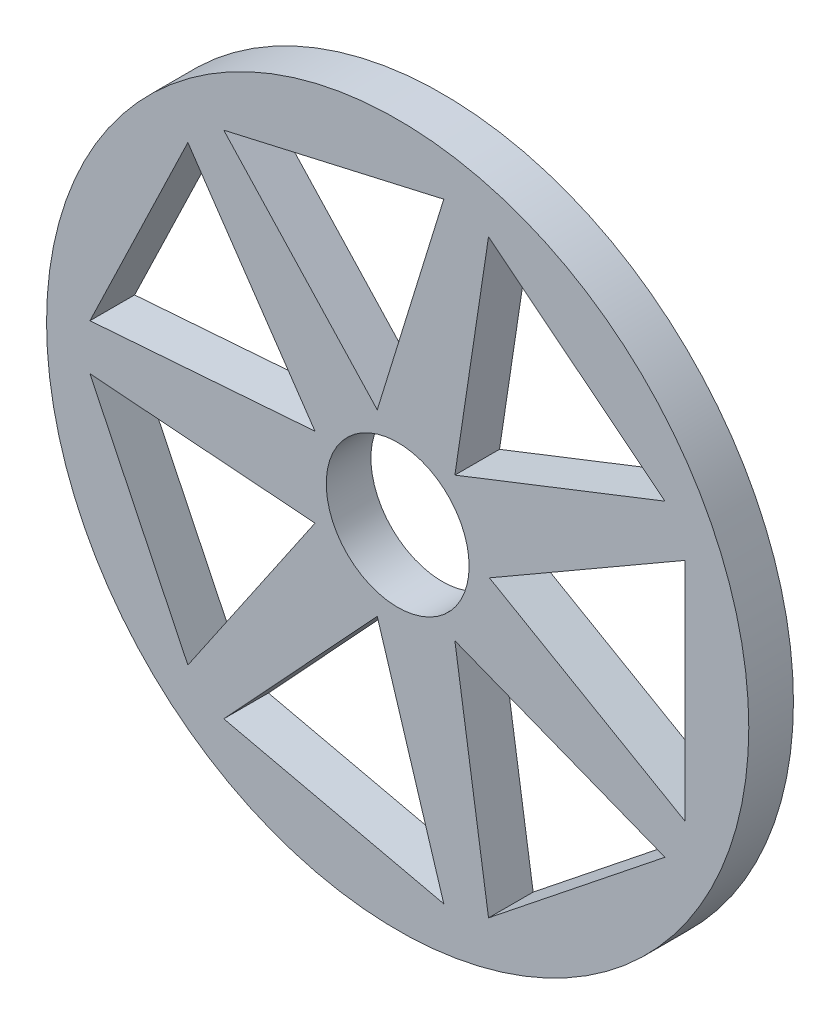
ISO-10303-21;
HEADER;
FILE_DESCRIPTION(('STEP AP214'),'2;1');
FILE_NAME('part.step','',(''),(''),'','','');
FILE_SCHEMA(('AUTOMOTIVE_DESIGN { 1 0 10303 214 1 1 1 1 }'));
ENDSEC;
DATA;
#1=APPLICATION_CONTEXT('core data for automotive mechanical design processes');
#2=APPLICATION_PROTOCOL_DEFINITION('international standard','automotive_design',2000,#1);
#3=PRODUCT_CONTEXT('',#1,'mechanical');
#4=PRODUCT('Part','Part','',(#3));
#5=PRODUCT_RELATED_PRODUCT_CATEGORY('part','',(#4));
#6=PRODUCT_DEFINITION_FORMATION('','',#4);
#7=PRODUCT_DEFINITION_CONTEXT('part definition',#1,'design');
#8=PRODUCT_DEFINITION('design','',#6,#7);
#9=PRODUCT_DEFINITION_SHAPE('','',#8);
#10=(LENGTH_UNIT() NAMED_UNIT(*) SI_UNIT(.MILLI.,.METRE.));
#11=(NAMED_UNIT(*) PLANE_ANGLE_UNIT() SI_UNIT($,.RADIAN.));
#12=(NAMED_UNIT(*) SI_UNIT($,.STERADIAN.) SOLID_ANGLE_UNIT());
#13=UNCERTAINTY_MEASURE_WITH_UNIT(LENGTH_MEASURE(1.E-05),#10,'distance_accuracy_value','');
#14=(GEOMETRIC_REPRESENTATION_CONTEXT(3) GLOBAL_UNCERTAINTY_ASSIGNED_CONTEXT((#13)) GLOBAL_UNIT_ASSIGNED_CONTEXT((#10,
#11,#12)) REPRESENTATION_CONTEXT('',''));
#15=CARTESIAN_POINT('',(0.,0.,0.));
#16=DIRECTION('',(0.,0.,1.));
#17=DIRECTION('',(1.,0.,0.));
#18=AXIS2_PLACEMENT_3D('',#15,#16,#17);
#19=CARTESIAN_POINT('',(-9.14249999999995,0.,6.985));
#20=DIRECTION('',(0.,0.,1.));
#21=DIRECTION('',(1.,0.,0.));
#22=AXIS2_PLACEMENT_3D('',#19,#20,#21);
#23=PLANE('',#22);
#24=CARTESIAN_POINT('',(-9.14249999999995,0.,6.985));
#25=DIRECTION('',(0.,0.,1.));
#26=DIRECTION('',(1.,0.,0.));
#27=AXIS2_PLACEMENT_3D('',#24,#25,#26);
#28=CIRCLE('',#27,54.9290000000001);
#29=CARTESIAN_POINT('',(45.7865000000002,0.,6.985));
#30=VERTEX_POINT('',#29);
#31=EDGE_CURVE('E12',#30,#30,#28,.T.);
#32=ORIENTED_EDGE('',*,*,#31,.T.);
#33=EDGE_LOOP('',(#32));
#34=FACE_BOUND('',#33,.T.);
#35=CARTESIAN_POINT('',(-9.14249999999995,0.,6.985));
#36=DIRECTION('',(0.,0.,1.));
#37=DIRECTION('',(1.,0.,0.));
#38=AXIS2_PLACEMENT_3D('',#35,#36,#37);
#39=CIRCLE('',#38,11.176);
#40=CARTESIAN_POINT('',(2.03350000000005,0.,6.985));
#41=VERTEX_POINT('',#40);
#42=EDGE_CURVE('E426',#41,#41,#39,.T.);
#43=ORIENTED_EDGE('',*,*,#42,.F.);
#44=EDGE_LOOP('',(#43));
#45=FACE_BOUND('',#44,.T.);
#46=DIRECTION('',(0.866025403784436,0.500000000000004,0.));
#47=VECTOR('',#46,1.);
#48=CARTESIAN_POINT('',(1.30212500000004,-2.25534665780566,6.98499999999996));
#49=LINE('',#48,#47);
#50=CARTESIAN_POINT('',(5.20850000000006,0.,6.985));
#51=VERTEX_POINT('',#50);
#52=CARTESIAN_POINT('',(35.7865000000002,17.6542165312807,6.98499999999996));
#53=VERTEX_POINT('',#52);
#54=EDGE_CURVE('E414',#51,#53,#49,.T.);
#55=ORIENTED_EDGE('',*,*,#54,.T.);
#56=DIRECTION('',(0.,-1.,0.));
#57=VECTOR('',#56,1.);
#58=CARTESIAN_POINT('',(35.7865000000002,0.,6.98499999999996));
#59=LINE('',#58,#57);
#60=CARTESIAN_POINT('',(35.7865000000002,-17.6542165312806,6.98499999999996));
#61=VERTEX_POINT('',#60);
#62=EDGE_CURVE('E411',#53,#61,#59,.T.);
#63=ORIENTED_EDGE('',*,*,#62,.T.);
#64=DIRECTION('',(-0.866025403784436,0.500000000000004,0.));
#65=VECTOR('',#64,1.);
#66=CARTESIAN_POINT('',(1.30212500000004,2.25534665780566,6.98499999999996));
#67=LINE('',#66,#65);
#68=EDGE_CURVE('E358',#61,#51,#67,.T.);
#69=ORIENTED_EDGE('',*,*,#68,.T.);
#70=EDGE_LOOP('',(#55,#63,#69));
#71=FACE_BOUND('',#70,.T.);
#72=DIRECTION('',(0.149042266176182,0.988830826225128,0.));
#73=VECTOR('',#72,1.);
#74=CARTESIAN_POINT('',(-1.84405659487136,0.2779468100787,6.98499999999996));
#75=LINE('',#74,#73);
#76=CARTESIAN_POINT('',(-0.194797853525107,11.2200636048986,6.985));
#77=VERTEX_POINT('',#76);
#78=CARTESIAN_POINT('',(5.067651025249,46.1341306428654,6.98499999999996));
#79=VERTEX_POINT('',#78);
#80=EDGE_CURVE('E293',#77,#79,#75,.T.);
#81=ORIENTED_EDGE('',*,*,#80,.T.);
#82=DIRECTION('',(0.781831482468022,-0.623489801858743,0.));
#83=VECTOR('',#82,1.);
#84=CARTESIAN_POINT('',(24.4587221270593,30.6702674572447,6.98499999999996));
#85=LINE('',#84,#83);
#86=CARTESIAN_POINT('',(32.6728955901742,24.1196827087464,6.98499999999996));
#87=VERTEX_POINT('',#86);
#88=EDGE_CURVE('E290',#79,#87,#85,.T.);
#89=ORIENTED_EDGE('',*,*,#88,.T.);
#90=DIRECTION('',(-0.93087374864421,-0.365341024366379,0.));
#91=VECTOR('',#90,1.);
#92=CARTESIAN_POINT('',(-3.84179115123878,9.78872421093177,6.98499999999996));
#93=LINE('',#92,#91);
#94=EDGE_CURVE('E287',#87,#77,#93,.T.);
#95=ORIENTED_EDGE('',*,*,#94,.T.);
#96=EDGE_LOOP('',(#81,#89,#95));
#97=FACE_BOUND('',#96,.T.);
#98=DIRECTION('',(-0.680172737770916,0.733051871829829,0.));
#99=VECTOR('',#98,1.);
#100=CARTESIAN_POINT('',(0.347153766008051,0.322111622010846,6.98499999999996));
#101=LINE('',#100,#99);
#102=CARTESIAN_POINT('',(-12.3358979232069,13.9911904677214,6.985));
#103=VERTEX_POINT('',#102);
#104=CARTESIAN_POINT('',(-36.3517315057701,39.87410341561,6.98499999999996));
#105=VERTEX_POINT('',#104);
#106=EDGE_CURVE('E261',#103,#105,#101,.T.);
#107=ORIENTED_EDGE('',*,*,#106,.T.);
#108=DIRECTION('',(0.974927912181826,0.222520933956306,0.));
#109=VECTOR('',#108,1.);
#110=CARTESIAN_POINT('',(-10.4503391043239,45.7859272088584,6.98499999999996));
#111=LINE('',#110,#109);
#112=CARTESIAN_POINT('',(-1.92855457767549,47.7309689172248,6.98499999999996));
#113=VERTEX_POINT('',#112);
#114=EDGE_CURVE('E254',#105,#113,#111,.T.);
#115=ORIENTED_EDGE('',*,*,#114,.T.);
#116=DIRECTION('',(-0.294755174410918,-0.955572805786137,0.));
#117=VECTOR('',#116,1.);
#118=CARTESIAN_POINT('',(-15.2049066650103,4.69009256940897,6.98499999999996));
#119=LINE('',#118,#117);
#120=EDGE_CURVE('E265',#113,#103,#119,.T.);
#121=ORIENTED_EDGE('',*,*,#120,.T.);
#122=EDGE_LOOP('',(#107,#115,#121));
#123=FACE_BOUND('',#122,.T.);
#124=DIRECTION('',(0.930873748644205,-0.365341024366392,0.));
#125=VECTOR('',#124,1.);
#126=CARTESIAN_POINT('',(-3.84179115123895,-9.78872421093183,6.98499999999996));
#127=LINE('',#126,#125);
#128=CARTESIAN_POINT('',(-0.194797853525305,-11.2200636048987,6.985));
#129=VERTEX_POINT('',#128);
#130=CARTESIAN_POINT('',(32.6728955901739,-24.1196827087469,6.98499999999996));
#131=VERTEX_POINT('',#130);
#132=EDGE_CURVE('E366',#129,#131,#127,.T.);
#133=ORIENTED_EDGE('',*,*,#132,.T.);
#134=DIRECTION('',(-0.781831482468031,-0.623489801858732,0.));
#135=VECTOR('',#134,1.);
#136=CARTESIAN_POINT('',(24.4587221270589,-30.6702674572451,6.98499999999996));
#137=LINE('',#136,#135);
#138=CARTESIAN_POINT('',(5.06765102524834,-46.1341306428656,6.98499999999996));
#139=VERTEX_POINT('',#138);
#140=EDGE_CURVE('E362',#131,#139,#137,.T.);
#141=ORIENTED_EDGE('',*,*,#140,.T.);
#142=DIRECTION('',(-0.149042266176168,0.98883082622513,0.));
#143=VECTOR('',#142,1.);
#144=CARTESIAN_POINT('',(-1.84405659487141,-0.277946810078672,6.98499999999996));
#145=LINE('',#144,#143);
#146=EDGE_CURVE('E359',#139,#129,#145,.T.);
#147=ORIENTED_EDGE('',*,*,#146,.T.);
#148=EDGE_LOOP('',(#133,#141,#147));
#149=FACE_BOUND('',#148,.T.);
#150=DIRECTION('',(0.294755174410905,-0.955572805786141,0.));
#151=VECTOR('',#150,1.);
#152=CARTESIAN_POINT('',(-15.2049066650105,-4.6900925694088,6.98499999999996));
#153=LINE('',#152,#151);
#154=CARTESIAN_POINT('',(-12.3358979232071,-13.9911904677213,6.985));
#155=VERTEX_POINT('',#154);
#156=CARTESIAN_POINT('',(-1.92855457767616,-47.7309689172248,6.98499999999996));
#157=VERTEX_POINT('',#156);
#158=EDGE_CURVE('E389',#155,#157,#153,.T.);
#159=ORIENTED_EDGE('',*,*,#158,.T.);
#160=DIRECTION('',(-0.974927912181823,0.222520933956318,0.));
#161=VECTOR('',#160,1.);
#162=CARTESIAN_POINT('',(-10.4503391043245,-45.7859272088584,6.98499999999996));
#163=LINE('',#162,#161);
#164=CARTESIAN_POINT('',(-36.3517315057707,-39.8741034156096,6.98499999999996));
#165=VERTEX_POINT('',#164);
#166=EDGE_CURVE('E386',#157,#165,#163,.T.);
#167=ORIENTED_EDGE('',*,*,#166,.T.);
#168=DIRECTION('',(0.680172737770926,0.733051871829821,0.));
#169=VECTOR('',#168,1.);
#170=CARTESIAN_POINT('',(0.347153766008051,-0.322111622010846,6.98499999999996));
#171=LINE('',#170,#169);
#172=EDGE_CURVE('E312',#165,#155,#171,.T.);
#173=ORIENTED_EDGE('',*,*,#172,.T.);
#174=EDGE_LOOP('',(#159,#167,#173));
#175=FACE_BOUND('',#174,.T.);
#176=DIRECTION('',(-0.563320058063623,-0.826238774315994,0.));
#177=VECTOR('',#176,1.);
#178=CARTESIAN_POINT('',(-12.1699914827393,8.29735970012538,6.98499999999996));
#179=LINE('',#178,#177);
#180=CARTESIAN_POINT('',(-22.0723042232676,-6.22666554007597,6.985));
#181=VERTEX_POINT('',#180);
#182=CARTESIAN_POINT('',(-41.962252786205,-35.3998619967047,6.98499999999996));
#183=VERTEX_POINT('',#182);
#184=EDGE_CURVE('E127',#181,#183,#179,.T.);
#185=ORIENTED_EDGE('',*,*,#184,.T.);
#186=DIRECTION('',(-0.433883739117553,0.900968867902422,0.));
#187=VECTOR('',#186,1.);
#188=CARTESIAN_POINT('',(-47.9010080227348,-23.0679096790445,6.98499999999996));
#189=LINE('',#188,#187);
#190=CARTESIAN_POINT('',(-57.2820077457709,-3.58806303292039,6.98499999999996));
#191=VERTEX_POINT('',#190);
#192=EDGE_CURVE('E316',#183,#191,#189,.T.);
#193=ORIENTED_EDGE('',*,*,#192,.T.);
#194=DIRECTION('',(0.997203797181179,-0.0747300935864348,0.));
#195=VECTOR('',#194,1.);
#196=CARTESIAN_POINT('',(-0.587282872147848,-7.83674530593151,6.98499999999996));
#197=LINE('',#196,#195);
#198=EDGE_CURVE('E313',#191,#181,#197,.T.);
#199=ORIENTED_EDGE('',*,*,#198,.T.);
#200=EDGE_LOOP('',(#185,#193,#199));
#201=FACE_BOUND('',#200,.T.);
#202=DIRECTION('',(-0.99720379718118,-0.0747300935864215,0.));
#203=VECTOR('',#202,1.);
#204=CARTESIAN_POINT('',(-0.587282872147765,7.83674530593148,6.98499999999996));
#205=LINE('',#204,#203);
#206=CARTESIAN_POINT('',(-22.0723042232675,6.22666554007623,6.985));
#207=VERTEX_POINT('',#206);
#208=CARTESIAN_POINT('',(-57.2820077457709,3.58806303292114,6.98499999999996));
#209=VERTEX_POINT('',#208);
#210=EDGE_CURVE('E119',#207,#209,#205,.T.);
#211=ORIENTED_EDGE('',*,*,#210,.T.);
#212=DIRECTION('',(0.433883739117565,0.900968867902416,0.));
#213=VECTOR('',#212,1.);
#214=CARTESIAN_POINT('',(-47.9010080227344,23.0679096790451,6.98499999999996));
#215=LINE('',#214,#213);
#216=CARTESIAN_POINT('',(-41.9622527862045,35.3998619967052,6.98499999999996));
#217=VERTEX_POINT('',#216);
#218=EDGE_CURVE('E338',#209,#217,#215,.T.);
#219=ORIENTED_EDGE('',*,*,#218,.T.);
#220=DIRECTION('',(0.563320058063612,-0.826238774316002,0.));
#221=VECTOR('',#220,1.);
#222=CARTESIAN_POINT('',(-12.1699914827395,-8.29735970012521,6.98499999999996));
#223=LINE('',#222,#221);
#224=EDGE_CURVE('E335',#217,#207,#223,.T.);
#225=ORIENTED_EDGE('',*,*,#224,.T.);
#226=EDGE_LOOP('',(#211,#219,#225));
#227=FACE_BOUND('',#226,.T.);
#228=ADVANCED_FACE('F104',(#34,#45,#71,#97,#123,#149,#175,#201,#227),#23,.T.);
#229=CARTESIAN_POINT('',(-9.14249999999995,0.,0.));
#230=DIRECTION('',(0.,0.,1.));
#231=DIRECTION('',(1.,0.,0.));
#232=AXIS2_PLACEMENT_3D('',#229,#230,#231);
#233=PLANE('',#232);
#234=DIRECTION('',(0.433883739117553,-0.900968867902422,0.));
#235=VECTOR('',#234,1.);
#236=CARTESIAN_POINT('',(-47.9010080227348,-23.0679096790445,0.));
#237=LINE('',#236,#235);
#238=CARTESIAN_POINT('',(-57.2820077457709,-3.58806303292041,0.));
#239=VERTEX_POINT('',#238);
#240=CARTESIAN_POINT('',(-41.962252786205,-35.3998619967047,0.));
#241=VERTEX_POINT('',#240);
#242=EDGE_CURVE('E309',#239,#241,#237,.T.);
#243=ORIENTED_EDGE('',*,*,#242,.T.);
#244=DIRECTION('',(0.563320058063623,0.826238774315994,0.));
#245=VECTOR('',#244,1.);
#246=CARTESIAN_POINT('',(-12.1699914827393,8.29735970012538,0.));
#247=LINE('',#246,#245);
#248=CARTESIAN_POINT('',(-22.0723042232676,-6.22666554007595,0.));
#249=VERTEX_POINT('',#248);
#250=EDGE_CURVE('E305',#241,#249,#247,.T.);
#251=ORIENTED_EDGE('',*,*,#250,.T.);
#252=DIRECTION('',(-0.997203797181179,0.0747300935864348,0.));
#253=VECTOR('',#252,1.);
#254=CARTESIAN_POINT('',(-0.587282872147848,-7.83674530593151,0.));
#255=LINE('',#254,#253);
#256=EDGE_CURVE('E308',#249,#239,#255,.T.);
#257=ORIENTED_EDGE('',*,*,#256,.T.);
#258=EDGE_LOOP('',(#243,#251,#257));
#259=FACE_BOUND('',#258,.T.);
#260=DIRECTION('',(0.781831482468031,0.623489801858732,0.));
#261=VECTOR('',#260,1.);
#262=CARTESIAN_POINT('',(24.4587221270589,-30.6702674572451,0.));
#263=LINE('',#262,#261);
#264=CARTESIAN_POINT('',(5.06765102524832,-46.1341306428656,0.));
#265=VERTEX_POINT('',#264);
#266=CARTESIAN_POINT('',(32.6728955901739,-24.1196827087469,0.));
#267=VERTEX_POINT('',#266);
#268=EDGE_CURVE('E355',#265,#267,#263,.T.);
#269=ORIENTED_EDGE('',*,*,#268,.T.);
#270=DIRECTION('',(-0.930873748644205,0.365341024366392,0.));
#271=VECTOR('',#270,1.);
#272=CARTESIAN_POINT('',(-3.84179115123895,-9.78872421093183,0.));
#273=LINE('',#272,#271);
#274=CARTESIAN_POINT('',(-0.194797853525303,-11.2200636048987,0.));
#275=VERTEX_POINT('',#274);
#276=EDGE_CURVE('E351',#267,#275,#273,.T.);
#277=ORIENTED_EDGE('',*,*,#276,.T.);
#278=DIRECTION('',(0.149042266176168,-0.98883082622513,0.));
#279=VECTOR('',#278,1.);
#280=CARTESIAN_POINT('',(-1.84405659487141,-0.277946810078672,0.));
#281=LINE('',#280,#279);
#282=EDGE_CURVE('E354',#275,#265,#281,.T.);
#283=ORIENTED_EDGE('',*,*,#282,.T.);
#284=EDGE_LOOP('',(#269,#277,#283));
#285=FACE_BOUND('',#284,.T.);
#286=DIRECTION('',(-0.781831482468022,0.623489801858743,0.));
#287=VECTOR('',#286,1.);
#288=CARTESIAN_POINT('',(24.4587221270593,30.6702674572447,0.));
#289=LINE('',#288,#287);
#290=CARTESIAN_POINT('',(32.6728955901742,24.1196827087464,0.));
#291=VERTEX_POINT('',#290);
#292=CARTESIAN_POINT('',(5.067651025249,46.1341306428654,0.));
#293=VERTEX_POINT('',#292);
#294=EDGE_CURVE('E284',#291,#293,#289,.T.);
#295=ORIENTED_EDGE('',*,*,#294,.T.);
#296=DIRECTION('',(-0.149042266176182,-0.988830826225128,0.));
#297=VECTOR('',#296,1.);
#298=CARTESIAN_POINT('',(-1.84405659487136,0.2779468100787,0.));
#299=LINE('',#298,#297);
#300=CARTESIAN_POINT('',(-0.194797853525118,11.2200636048986,0.));
#301=VERTEX_POINT('',#300);
#302=EDGE_CURVE('E281',#293,#301,#299,.T.);
#303=ORIENTED_EDGE('',*,*,#302,.T.);
#304=DIRECTION('',(0.93087374864421,0.365341024366379,0.));
#305=VECTOR('',#304,1.);
#306=CARTESIAN_POINT('',(-3.84179115123878,9.78872421093177,0.));
#307=LINE('',#306,#305);
#308=EDGE_CURVE('E270',#301,#291,#307,.T.);
#309=ORIENTED_EDGE('',*,*,#308,.T.);
#310=EDGE_LOOP('',(#295,#303,#309));
#311=FACE_BOUND('',#310,.T.);
#312=CARTESIAN_POINT('',(-9.14249999999995,0.,0.));
#313=DIRECTION('',(0.,0.,1.));
#314=DIRECTION('',(1.,0.,0.));
#315=AXIS2_PLACEMENT_3D('',#312,#313,#314);
#316=CIRCLE('',#315,11.176);
#317=CARTESIAN_POINT('',(2.03350000000005,0.,0.));
#318=VERTEX_POINT('',#317);
#319=EDGE_CURVE('E408',#318,#318,#316,.T.);
#320=ORIENTED_EDGE('',*,*,#319,.T.);
#321=EDGE_LOOP('',(#320));
#322=FACE_BOUND('',#321,.T.);
#323=CARTESIAN_POINT('',(-9.14249999999995,0.,0.));
#324=DIRECTION('',(0.,0.,1.));
#325=DIRECTION('',(1.,0.,0.));
#326=AXIS2_PLACEMENT_3D('',#323,#324,#325);
#327=CIRCLE('',#326,54.9290000000001);
#328=CARTESIAN_POINT('',(45.7865000000002,0.,0.));
#329=VERTEX_POINT('',#328);
#330=EDGE_CURVE('E108',#329,#329,#327,.T.);
#331=ORIENTED_EDGE('',*,*,#330,.F.);
#332=EDGE_LOOP('',(#331));
#333=FACE_BOUND('',#332,.T.);
#334=DIRECTION('',(0.,1.,0.));
#335=VECTOR('',#334,1.);
#336=CARTESIAN_POINT('',(35.7865000000002,0.,0.));
#337=LINE('',#336,#335);
#338=CARTESIAN_POINT('',(35.7865000000002,-17.6542165312806,0.));
#339=VERTEX_POINT('',#338);
#340=CARTESIAN_POINT('',(35.7865000000002,17.6542165312807,0.));
#341=VERTEX_POINT('',#340);
#342=EDGE_CURVE('E405',#339,#341,#337,.T.);
#343=ORIENTED_EDGE('',*,*,#342,.T.);
#344=DIRECTION('',(-0.866025403784436,-0.500000000000004,0.));
#345=VECTOR('',#344,1.);
#346=CARTESIAN_POINT('',(1.30212500000004,-2.25534665780566,0.));
#347=LINE('',#346,#345);
#348=CARTESIAN_POINT('',(5.20850000000006,0.,0.));
#349=VERTEX_POINT('',#348);
#350=EDGE_CURVE('E401',#341,#349,#347,.T.);
#351=ORIENTED_EDGE('',*,*,#350,.T.);
#352=DIRECTION('',(0.866025403784436,-0.500000000000004,0.));
#353=VECTOR('',#352,1.);
#354=CARTESIAN_POINT('',(1.30212500000004,2.25534665780566,0.));
#355=LINE('',#354,#353);
#356=EDGE_CURVE('E404',#349,#339,#355,.T.);
#357=ORIENTED_EDGE('',*,*,#356,.T.);
#358=EDGE_LOOP('',(#343,#351,#357));
#359=FACE_BOUND('',#358,.T.);
#360=DIRECTION('',(-0.974927912181826,-0.222520933956306,0.));
#361=VECTOR('',#360,1.);
#362=CARTESIAN_POINT('',(-10.4503391043239,45.7859272088584,0.));
#363=LINE('',#362,#361);
#364=CARTESIAN_POINT('',(-1.92855457767548,47.7309689172248,0.));
#365=VERTEX_POINT('',#364);
#366=CARTESIAN_POINT('',(-36.3517315057701,39.87410341561,0.));
#367=VERTEX_POINT('',#366);
#368=EDGE_CURVE('E257',#365,#367,#363,.T.);
#369=ORIENTED_EDGE('',*,*,#368,.T.);
#370=DIRECTION('',(0.680172737770916,-0.733051871829829,0.));
#371=VECTOR('',#370,1.);
#372=CARTESIAN_POINT('',(0.347153766008051,0.322111622010846,0.));
#373=LINE('',#372,#371);
#374=CARTESIAN_POINT('',(-12.3358979232068,13.9911904677214,0.));
#375=VERTEX_POINT('',#374);
#376=EDGE_CURVE('E280',#367,#375,#373,.T.);
#377=ORIENTED_EDGE('',*,*,#376,.T.);
#378=DIRECTION('',(0.294755174410918,0.955572805786137,0.));
#379=VECTOR('',#378,1.);
#380=CARTESIAN_POINT('',(-15.2049066650103,4.69009256940897,0.));
#381=LINE('',#380,#379);
#382=EDGE_CURVE('E339',#375,#365,#381,.T.);
#383=ORIENTED_EDGE('',*,*,#382,.T.);
#384=EDGE_LOOP('',(#369,#377,#383));
#385=FACE_BOUND('',#384,.T.);
#386=DIRECTION('',(0.974927912181823,-0.222520933956318,0.));
#387=VECTOR('',#386,1.);
#388=CARTESIAN_POINT('',(-10.4503391043245,-45.7859272088584,0.));
#389=LINE('',#388,#387);
#390=CARTESIAN_POINT('',(-36.3517315057707,-39.8741034156096,0.));
#391=VERTEX_POINT('',#390);
#392=CARTESIAN_POINT('',(-1.92855457767616,-47.7309689172248,0.));
#393=VERTEX_POINT('',#392);
#394=EDGE_CURVE('E381',#391,#393,#389,.T.);
#395=ORIENTED_EDGE('',*,*,#394,.T.);
#396=DIRECTION('',(-0.294755174410905,0.95557280578614,0.));
#397=VECTOR('',#396,1.);
#398=CARTESIAN_POINT('',(-15.2049066650105,-4.6900925694088,0.));
#399=LINE('',#398,#397);
#400=CARTESIAN_POINT('',(-12.3358979232071,-13.9911904677213,0.));
#401=VERTEX_POINT('',#400);
#402=EDGE_CURVE('E378',#393,#401,#399,.T.);
#403=ORIENTED_EDGE('',*,*,#402,.T.);
#404=DIRECTION('',(-0.680172737770926,-0.733051871829821,0.));
#405=VECTOR('',#404,1.);
#406=CARTESIAN_POINT('',(0.347153766008051,-0.322111622010846,0.));
#407=LINE('',#406,#405);
#408=EDGE_CURVE('E363',#401,#391,#407,.T.);
#409=ORIENTED_EDGE('',*,*,#408,.T.);
#410=EDGE_LOOP('',(#395,#403,#409));
#411=FACE_BOUND('',#410,.T.);
#412=DIRECTION('',(-0.433883739117565,-0.900968867902416,0.));
#413=VECTOR('',#412,1.);
#414=CARTESIAN_POINT('',(-47.9010080227344,23.0679096790451,0.));
#415=LINE('',#414,#413);
#416=CARTESIAN_POINT('',(-41.9622527862045,35.3998619967052,0.));
#417=VERTEX_POINT('',#416);
#418=CARTESIAN_POINT('',(-57.2820077457709,3.58806303292114,0.));
#419=VERTEX_POINT('',#418);
#420=EDGE_CURVE('E332',#417,#419,#415,.T.);
#421=ORIENTED_EDGE('',*,*,#420,.T.);
#422=DIRECTION('',(0.99720379718118,0.0747300935864215,0.));
#423=VECTOR('',#422,1.);
#424=CARTESIAN_POINT('',(-0.587282872147765,7.83674530593148,0.));
#425=LINE('',#424,#423);
#426=CARTESIAN_POINT('',(-22.0723042232675,6.22666554007623,0.));
#427=VERTEX_POINT('',#426);
#428=EDGE_CURVE('E329',#419,#427,#425,.T.);
#429=ORIENTED_EDGE('',*,*,#428,.T.);
#430=DIRECTION('',(-0.563320058063612,0.826238774316002,0.));
#431=VECTOR('',#430,1.);
#432=CARTESIAN_POINT('',(-12.1699914827395,-8.29735970012521,0.));
#433=LINE('',#432,#431);
#434=EDGE_CURVE('E317',#427,#417,#433,.T.);
#435=ORIENTED_EDGE('',*,*,#434,.T.);
#436=EDGE_LOOP('',(#421,#429,#435));
#437=FACE_BOUND('',#436,.T.);
#438=ADVANCED_FACE('F432',(#259,#285,#311,#322,#333,#359,#385,#411,#437),#233,.F.);
#439=CARTESIAN_POINT('',(-9.14249999999995,0.,6.985));
#440=DIRECTION('',(0.,0.,-1.));
#441=DIRECTION('',(-1.,0.,0.));
#442=AXIS2_PLACEMENT_3D('',#439,#440,#441);
#443=CYLINDRICAL_SURFACE('',#442,54.9290000000001);
#444=ORIENTED_EDGE('',*,*,#31,.F.);
#445=EDGE_LOOP('',(#444));
#446=FACE_BOUND('',#445,.T.);
#447=ORIENTED_EDGE('',*,*,#330,.T.);
#448=EDGE_LOOP('',(#447));
#449=FACE_BOUND('',#448,.T.);
#450=ADVANCED_FACE('F106',(#446,#449),#443,.T.);
#451=CARTESIAN_POINT('',(-9.14249999999995,0.,6.985));
#452=DIRECTION('',(0.,0.,-1.));
#453=DIRECTION('',(-1.,0.,0.));
#454=AXIS2_PLACEMENT_3D('',#451,#452,#453);
#455=CYLINDRICAL_SURFACE('',#454,11.176);
#456=ORIENTED_EDGE('',*,*,#42,.T.);
#457=EDGE_LOOP('',(#456));
#458=FACE_BOUND('',#457,.T.);
#459=ORIENTED_EDGE('',*,*,#319,.F.);
#460=EDGE_LOOP('',(#459));
#461=FACE_BOUND('',#460,.T.);
#462=ADVANCED_FACE('F435',(#458,#461),#455,.F.);
#463=CARTESIAN_POINT('',(35.7865000000002,0.,-48.200910361159));
#464=DIRECTION('',(-1.,0.,0.));
#465=DIRECTION('',(0.,-1.,0.));
#466=AXIS2_PLACEMENT_3D('',#463,#464,#465);
#467=PLANE('',#466);
#468=DIRECTION('',(0.,0.,1.));
#469=VECTOR('',#468,1.);
#470=CARTESIAN_POINT('',(35.7865000000002,-17.6542165312806,-48.200910361159));
#471=LINE('',#470,#469);
#472=EDGE_CURVE('E417',#339,#61,#471,.T.);
#473=ORIENTED_EDGE('',*,*,#472,.T.);
#474=ORIENTED_EDGE('',*,*,#62,.F.);
#475=DIRECTION('',(0.,0.,1.));
#476=VECTOR('',#475,1.);
#477=CARTESIAN_POINT('',(35.7865000000002,17.6542165312807,-48.200910361159));
#478=LINE('',#477,#476);
#479=EDGE_CURVE('E421',#341,#53,#478,.T.);
#480=ORIENTED_EDGE('',*,*,#479,.F.);
#481=ORIENTED_EDGE('',*,*,#342,.F.);
#482=EDGE_LOOP('',(#473,#474,#480,#481));
#483=FACE_BOUND('',#482,.T.);
#484=ADVANCED_FACE('F437',(#483),#467,.T.);
#485=CARTESIAN_POINT('',(1.30212500000004,-2.25534665780566,-48.200910361159));
#486=DIRECTION('',(0.500000000000004,-0.866025403784436,0.));
#487=DIRECTION('',(0.866025403784436,0.500000000000004,0.));
#488=AXIS2_PLACEMENT_3D('',#485,#486,#487);
#489=PLANE('',#488);
#490=ORIENTED_EDGE('',*,*,#479,.T.);
#491=ORIENTED_EDGE('',*,*,#54,.F.);
#492=DIRECTION('',(0.,0.,1.));
#493=VECTOR('',#492,1.);
#494=CARTESIAN_POINT('',(5.20850000000006,0.,-48.200910361159));
#495=LINE('',#494,#493);
#496=EDGE_CURVE('E418',#349,#51,#495,.T.);
#497=ORIENTED_EDGE('',*,*,#496,.F.);
#498=ORIENTED_EDGE('',*,*,#350,.F.);
#499=EDGE_LOOP('',(#490,#491,#497,#498));
#500=FACE_BOUND('',#499,.T.);
#501=ADVANCED_FACE('F444',(#500),#489,.T.);
#502=CARTESIAN_POINT('',(1.30212500000004,2.25534665780566,-48.200910361159));
#503=DIRECTION('',(0.500000000000004,0.866025403784436,0.));
#504=DIRECTION('',(-0.866025403784436,0.500000000000004,0.));
#505=AXIS2_PLACEMENT_3D('',#502,#503,#504);
#506=PLANE('',#505);
#507=ORIENTED_EDGE('',*,*,#496,.T.);
#508=ORIENTED_EDGE('',*,*,#68,.F.);
#509=ORIENTED_EDGE('',*,*,#472,.F.);
#510=ORIENTED_EDGE('',*,*,#356,.F.);
#511=EDGE_LOOP('',(#507,#508,#509,#510));
#512=FACE_BOUND('',#511,.T.);
#513=ADVANCED_FACE('F474',(#512),#506,.T.);
#514=CARTESIAN_POINT('',(24.4587221270593,30.6702674572447,-48.200910361159));
#515=DIRECTION('',(-0.623489801858743,-0.781831482468022,0.));
#516=DIRECTION('',(0.781831482468022,-0.623489801858743,0.));
#517=AXIS2_PLACEMENT_3D('',#514,#515,#516);
#518=PLANE('',#517);
#519=DIRECTION('',(0.,0.,1.));
#520=VECTOR('',#519,1.);
#521=CARTESIAN_POINT('',(32.6728955901742,24.1196827087464,-48.200910361159));
#522=LINE('',#521,#520);
#523=EDGE_CURVE('E296',#291,#87,#522,.T.);
#524=ORIENTED_EDGE('',*,*,#523,.T.);
#525=ORIENTED_EDGE('',*,*,#88,.F.);
#526=DIRECTION('',(0.,0.,1.));
#527=VECTOR('',#526,1.);
#528=CARTESIAN_POINT('',(5.067651025249,46.1341306428654,-48.200910361159));
#529=LINE('',#528,#527);
#530=EDGE_CURVE('E300',#293,#79,#529,.T.);
#531=ORIENTED_EDGE('',*,*,#530,.F.);
#532=ORIENTED_EDGE('',*,*,#294,.F.);
#533=EDGE_LOOP('',(#524,#525,#531,#532));
#534=FACE_BOUND('',#533,.T.);
#535=ADVANCED_FACE('F472',(#534),#518,.T.);
#536=CARTESIAN_POINT('',(-1.84405659487136,0.2779468100787,-48.200910361159));
#537=DIRECTION('',(0.988830826225128,-0.149042266176182,0.));
#538=DIRECTION('',(0.149042266176182,0.988830826225128,0.));
#539=AXIS2_PLACEMENT_3D('',#536,#537,#538);
#540=PLANE('',#539);
#541=ORIENTED_EDGE('',*,*,#530,.T.);
#542=ORIENTED_EDGE('',*,*,#80,.F.);
#543=DIRECTION('',(0.,0.,1.));
#544=VECTOR('',#543,1.);
#545=CARTESIAN_POINT('',(-0.194797853525108,11.2200636048986,-48.200910361159));
#546=LINE('',#545,#544);
#547=EDGE_CURVE('E297',#301,#77,#546,.T.);
#548=ORIENTED_EDGE('',*,*,#547,.F.);
#549=ORIENTED_EDGE('',*,*,#302,.F.);
#550=EDGE_LOOP('',(#541,#542,#548,#549));
#551=FACE_BOUND('',#550,.T.);
#552=ADVANCED_FACE('F465',(#551),#540,.T.);
#553=CARTESIAN_POINT('',(-3.84179115123878,9.78872421093177,-48.200910361159));
#554=DIRECTION('',(-0.365341024366379,0.93087374864421,0.));
#555=DIRECTION('',(-0.93087374864421,-0.365341024366379,0.));
#556=AXIS2_PLACEMENT_3D('',#553,#554,#555);
#557=PLANE('',#556);
#558=ORIENTED_EDGE('',*,*,#547,.T.);
#559=ORIENTED_EDGE('',*,*,#94,.F.);
#560=ORIENTED_EDGE('',*,*,#523,.F.);
#561=ORIENTED_EDGE('',*,*,#308,.F.);
#562=EDGE_LOOP('',(#558,#559,#560,#561));
#563=FACE_BOUND('',#562,.T.);
#564=ADVANCED_FACE('F468',(#563),#557,.T.);
#565=CARTESIAN_POINT('',(-10.4503391043239,45.7859272088584,-48.200910361159));
#566=DIRECTION('',(0.222520933956306,-0.974927912181826,0.));
#567=DIRECTION('',(0.974927912181826,0.222520933956306,0.));
#568=AXIS2_PLACEMENT_3D('',#565,#566,#567);
#569=PLANE('',#568);
#570=DIRECTION('',(0.,0.,1.));
#571=VECTOR('',#570,1.);
#572=CARTESIAN_POINT('',(-1.92855457767549,47.7309689172248,-48.200910361159));
#573=LINE('',#572,#571);
#574=EDGE_CURVE('E249',#365,#113,#573,.T.);
#575=ORIENTED_EDGE('',*,*,#574,.T.);
#576=ORIENTED_EDGE('',*,*,#114,.F.);
#577=DIRECTION('',(0.,0.,1.));
#578=VECTOR('',#577,1.);
#579=CARTESIAN_POINT('',(-36.3517315057701,39.87410341561,-48.200910361159));
#580=LINE('',#579,#578);
#581=EDGE_CURVE('E260',#367,#105,#580,.T.);
#582=ORIENTED_EDGE('',*,*,#581,.F.);
#583=ORIENTED_EDGE('',*,*,#368,.F.);
#584=EDGE_LOOP('',(#575,#576,#582,#583));
#585=FACE_BOUND('',#584,.T.);
#586=ADVANCED_FACE('F251',(#585),#569,.T.);
#587=CARTESIAN_POINT('',(0.347153766008051,0.322111622010846,-48.200910361159));
#588=DIRECTION('',(0.733051871829829,0.680172737770916,0.));
#589=DIRECTION('',(-0.680172737770916,0.733051871829829,0.));
#590=AXIS2_PLACEMENT_3D('',#587,#588,#589);
#591=PLANE('',#590);
#592=ORIENTED_EDGE('',*,*,#581,.T.);
#593=ORIENTED_EDGE('',*,*,#106,.F.);
#594=DIRECTION('',(0.,0.,1.));
#595=VECTOR('',#594,1.);
#596=CARTESIAN_POINT('',(-12.3358979232069,13.9911904677214,-48.200910361159));
#597=LINE('',#596,#595);
#598=EDGE_CURVE('E268',#375,#103,#597,.T.);
#599=ORIENTED_EDGE('',*,*,#598,.F.);
#600=ORIENTED_EDGE('',*,*,#376,.F.);
#601=EDGE_LOOP('',(#592,#593,#599,#600));
#602=FACE_BOUND('',#601,.T.);
#603=ADVANCED_FACE('F570',(#602),#591,.T.);
#604=CARTESIAN_POINT('',(-15.2049066650103,4.69009256940897,-48.200910361159));
#605=DIRECTION('',(-0.955572805786137,0.294755174410918,0.));
#606=DIRECTION('',(-0.294755174410918,-0.955572805786137,0.));
#607=AXIS2_PLACEMENT_3D('',#604,#605,#606);
#608=PLANE('',#607);
#609=ORIENTED_EDGE('',*,*,#598,.T.);
#610=ORIENTED_EDGE('',*,*,#120,.F.);
#611=ORIENTED_EDGE('',*,*,#574,.F.);
#612=ORIENTED_EDGE('',*,*,#382,.F.);
#613=EDGE_LOOP('',(#609,#610,#611,#612));
#614=FACE_BOUND('',#613,.T.);
#615=ADVANCED_FACE('F266',(#614),#608,.T.);
#616=CARTESIAN_POINT('',(24.4587221270589,-30.6702674572451,-48.200910361159));
#617=DIRECTION('',(-0.623489801858732,0.781831482468031,0.));
#618=DIRECTION('',(-0.781831482468031,-0.623489801858732,0.));
#619=AXIS2_PLACEMENT_3D('',#616,#617,#618);
#620=PLANE('',#619);
#621=DIRECTION('',(0.,0.,1.));
#622=VECTOR('',#621,1.);
#623=CARTESIAN_POINT('',(5.06765102524834,-46.1341306428656,-48.200910361159));
#624=LINE('',#623,#622);
#625=EDGE_CURVE('E369',#265,#139,#624,.T.);
#626=ORIENTED_EDGE('',*,*,#625,.T.);
#627=ORIENTED_EDGE('',*,*,#140,.F.);
#628=DIRECTION('',(0.,0.,1.));
#629=VECTOR('',#628,1.);
#630=CARTESIAN_POINT('',(32.6728955901739,-24.1196827087469,-48.200910361159));
#631=LINE('',#630,#629);
#632=EDGE_CURVE('E373',#267,#131,#631,.T.);
#633=ORIENTED_EDGE('',*,*,#632,.F.);
#634=ORIENTED_EDGE('',*,*,#268,.F.);
#635=EDGE_LOOP('',(#626,#627,#633,#634));
#636=FACE_BOUND('',#635,.T.);
#637=ADVANCED_FACE('F513',(#636),#620,.T.);
#638=CARTESIAN_POINT('',(-3.84179115123895,-9.78872421093183,-48.200910361159));
#639=DIRECTION('',(-0.365341024366392,-0.930873748644205,0.));
#640=DIRECTION('',(0.930873748644205,-0.365341024366392,0.));
#641=AXIS2_PLACEMENT_3D('',#638,#639,#640);
#642=PLANE('',#641);
#643=ORIENTED_EDGE('',*,*,#632,.T.);
#644=ORIENTED_EDGE('',*,*,#132,.F.);
#645=DIRECTION('',(0.,0.,1.));
#646=VECTOR('',#645,1.);
#647=CARTESIAN_POINT('',(-0.194797853525303,-11.2200636048987,-48.200910361159));
#648=LINE('',#647,#646);
#649=EDGE_CURVE('E370',#275,#129,#648,.T.);
#650=ORIENTED_EDGE('',*,*,#649,.F.);
#651=ORIENTED_EDGE('',*,*,#276,.F.);
#652=EDGE_LOOP('',(#643,#644,#650,#651));
#653=FACE_BOUND('',#652,.T.);
#654=ADVANCED_FACE('F509',(#653),#642,.T.);
#655=CARTESIAN_POINT('',(-1.84405659487141,-0.277946810078672,-48.200910361159));
#656=DIRECTION('',(0.988830826225129,0.149042266176168,0.));
#657=DIRECTION('',(-0.149042266176168,0.98883082622513,0.));
#658=AXIS2_PLACEMENT_3D('',#655,#656,#657);
#659=PLANE('',#658);
#660=ORIENTED_EDGE('',*,*,#649,.T.);
#661=ORIENTED_EDGE('',*,*,#146,.F.);
#662=ORIENTED_EDGE('',*,*,#625,.F.);
#663=ORIENTED_EDGE('',*,*,#282,.F.);
#664=EDGE_LOOP('',(#660,#661,#662,#663));
#665=FACE_BOUND('',#664,.T.);
#666=ADVANCED_FACE('F512',(#665),#659,.T.);
#667=CARTESIAN_POINT('',(-10.4503391043245,-45.7859272088584,-48.200910361159));
#668=DIRECTION('',(0.222520933956318,0.974927912181823,0.));
#669=DIRECTION('',(-0.974927912181823,0.222520933956318,0.));
#670=AXIS2_PLACEMENT_3D('',#667,#668,#669);
#671=PLANE('',#670);
#672=DIRECTION('',(0.,0.,1.));
#673=VECTOR('',#672,1.);
#674=CARTESIAN_POINT('',(-36.3517315057707,-39.8741034156096,-48.200910361159));
#675=LINE('',#674,#673);
#676=EDGE_CURVE('E392',#391,#165,#675,.T.);
#677=ORIENTED_EDGE('',*,*,#676,.T.);
#678=ORIENTED_EDGE('',*,*,#166,.F.);
#679=DIRECTION('',(0.,0.,1.));
#680=VECTOR('',#679,1.);
#681=CARTESIAN_POINT('',(-1.92855457767616,-47.7309689172248,-48.200910361159));
#682=LINE('',#681,#680);
#683=EDGE_CURVE('E396',#393,#157,#682,.T.);
#684=ORIENTED_EDGE('',*,*,#683,.F.);
#685=ORIENTED_EDGE('',*,*,#394,.F.);
#686=EDGE_LOOP('',(#677,#678,#684,#685));
#687=FACE_BOUND('',#686,.T.);
#688=ADVANCED_FACE('F520',(#687),#671,.T.);
#689=CARTESIAN_POINT('',(-15.2049066650105,-4.6900925694088,-48.200910361159));
#690=DIRECTION('',(-0.955572805786141,-0.294755174410905,0.));
#691=DIRECTION('',(0.294755174410905,-0.95557280578614,0.));
#692=AXIS2_PLACEMENT_3D('',#689,#690,#691);
#693=PLANE('',#692);
#694=ORIENTED_EDGE('',*,*,#683,.T.);
#695=ORIENTED_EDGE('',*,*,#158,.F.);
#696=DIRECTION('',(0.,0.,1.));
#697=VECTOR('',#696,1.);
#698=CARTESIAN_POINT('',(-12.3358979232071,-13.9911904677213,-48.200910361159));
#699=LINE('',#698,#697);
#700=EDGE_CURVE('E393',#401,#155,#699,.T.);
#701=ORIENTED_EDGE('',*,*,#700,.F.);
#702=ORIENTED_EDGE('',*,*,#402,.F.);
#703=EDGE_LOOP('',(#694,#695,#701,#702));
#704=FACE_BOUND('',#703,.T.);
#705=ADVANCED_FACE('F522',(#704),#693,.T.);
#706=CARTESIAN_POINT('',(0.347153766008051,-0.322111622010846,-48.200910361159));
#707=DIRECTION('',(0.733051871829821,-0.680172737770926,0.));
#708=DIRECTION('',(0.680172737770926,0.733051871829821,0.));
#709=AXIS2_PLACEMENT_3D('',#706,#707,#708);
#710=PLANE('',#709);
#711=ORIENTED_EDGE('',*,*,#700,.T.);
#712=ORIENTED_EDGE('',*,*,#172,.F.);
#713=ORIENTED_EDGE('',*,*,#676,.F.);
#714=ORIENTED_EDGE('',*,*,#408,.F.);
#715=EDGE_LOOP('',(#711,#712,#713,#714));
#716=FACE_BOUND('',#715,.T.);
#717=ADVANCED_FACE('F493',(#716),#710,.T.);
#718=CARTESIAN_POINT('',(-47.9010080227348,-23.0679096790445,-48.200910361159));
#719=DIRECTION('',(0.900968867902422,0.433883739117553,0.));
#720=DIRECTION('',(-0.433883739117553,0.900968867902422,0.));
#721=AXIS2_PLACEMENT_3D('',#718,#719,#720);
#722=PLANE('',#721);
#723=DIRECTION('',(0.,0.,1.));
#724=VECTOR('',#723,1.);
#725=CARTESIAN_POINT('',(-57.2820077457709,-3.58806303292039,-48.200910361159));
#726=LINE('',#725,#724);
#727=EDGE_CURVE('E321',#239,#191,#726,.T.);
#728=ORIENTED_EDGE('',*,*,#727,.T.);
#729=ORIENTED_EDGE('',*,*,#192,.F.);
#730=DIRECTION('',(0.,0.,1.));
#731=VECTOR('',#730,1.);
#732=CARTESIAN_POINT('',(-41.962252786205,-35.3998619967047,-48.200910361159));
#733=LINE('',#732,#731);
#734=EDGE_CURVE('E324',#241,#183,#733,.T.);
#735=ORIENTED_EDGE('',*,*,#734,.F.);
#736=ORIENTED_EDGE('',*,*,#242,.F.);
#737=EDGE_LOOP('',(#728,#729,#735,#736));
#738=FACE_BOUND('',#737,.T.);
#739=ADVANCED_FACE('F490',(#738),#722,.T.);
#740=CARTESIAN_POINT('',(-12.1699914827393,8.29735970012538,-48.200910361159));
#741=DIRECTION('',(-0.826238774315994,0.563320058063623,0.));
#742=DIRECTION('',(-0.563320058063623,-0.826238774315994,0.));
#743=AXIS2_PLACEMENT_3D('',#740,#741,#742);
#744=PLANE('',#743);
#745=ORIENTED_EDGE('',*,*,#734,.T.);
#746=ORIENTED_EDGE('',*,*,#184,.F.);
#747=DIRECTION('',(0.,0.,1.));
#748=VECTOR('',#747,1.);
#749=CARTESIAN_POINT('',(-22.0723042232676,-6.22666554007595,-48.200910361159));
#750=LINE('',#749,#748);
#751=EDGE_CURVE('E322',#249,#181,#750,.T.);
#752=ORIENTED_EDGE('',*,*,#751,.F.);
#753=ORIENTED_EDGE('',*,*,#250,.F.);
#754=EDGE_LOOP('',(#745,#746,#752,#753));
#755=FACE_BOUND('',#754,.T.);
#756=ADVANCED_FACE('F486',(#755),#744,.T.);
#757=CARTESIAN_POINT('',(-0.587282872147848,-7.83674530593151,-48.200910361159));
#758=DIRECTION('',(-0.0747300935864348,-0.997203797181179,0.));
#759=DIRECTION('',(0.997203797181179,-0.0747300935864348,0.));
#760=AXIS2_PLACEMENT_3D('',#757,#758,#759);
#761=PLANE('',#760);
#762=ORIENTED_EDGE('',*,*,#751,.T.);
#763=ORIENTED_EDGE('',*,*,#198,.F.);
#764=ORIENTED_EDGE('',*,*,#727,.F.);
#765=ORIENTED_EDGE('',*,*,#256,.F.);
#766=EDGE_LOOP('',(#762,#763,#764,#765));
#767=FACE_BOUND('',#766,.T.);
#768=ADVANCED_FACE('F489',(#767),#761,.T.);
#769=CARTESIAN_POINT('',(-47.9010080227344,23.0679096790451,-48.200910361159));
#770=DIRECTION('',(0.900968867902416,-0.433883739117565,0.));
#771=DIRECTION('',(0.433883739117565,0.900968867902416,0.));
#772=AXIS2_PLACEMENT_3D('',#769,#770,#771);
#773=PLANE('',#772);
#774=DIRECTION('',(0.,0.,1.));
#775=VECTOR('',#774,1.);
#776=CARTESIAN_POINT('',(-41.9622527862045,35.3998619967052,-48.200910361159));
#777=LINE('',#776,#775);
#778=EDGE_CURVE('E343',#417,#217,#777,.T.);
#779=ORIENTED_EDGE('',*,*,#778,.T.);
#780=ORIENTED_EDGE('',*,*,#218,.F.);
#781=DIRECTION('',(0.,0.,1.));
#782=VECTOR('',#781,1.);
#783=CARTESIAN_POINT('',(-57.2820077457709,3.58806303292114,-48.200910361159));
#784=LINE('',#783,#782);
#785=EDGE_CURVE('E346',#419,#209,#784,.T.);
#786=ORIENTED_EDGE('',*,*,#785,.F.);
#787=ORIENTED_EDGE('',*,*,#420,.F.);
#788=EDGE_LOOP('',(#779,#780,#786,#787));
#789=FACE_BOUND('',#788,.T.);
#790=ADVANCED_FACE('F497',(#789),#773,.T.);
#791=CARTESIAN_POINT('',(-0.587282872147765,7.83674530593148,-48.200910361159));
#792=DIRECTION('',(-0.0747300935864215,0.99720379718118,0.));
#793=DIRECTION('',(-0.99720379718118,-0.0747300935864215,0.));
#794=AXIS2_PLACEMENT_3D('',#791,#792,#793);
#795=PLANE('',#794);
#796=ORIENTED_EDGE('',*,*,#785,.T.);
#797=ORIENTED_EDGE('',*,*,#210,.F.);
#798=DIRECTION('',(0.,0.,1.));
#799=VECTOR('',#798,1.);
#800=CARTESIAN_POINT('',(-22.0723042232675,6.22666554007623,-48.200910361159));
#801=LINE('',#800,#799);
#802=EDGE_CURVE('E344',#427,#207,#801,.T.);
#803=ORIENTED_EDGE('',*,*,#802,.F.);
#804=ORIENTED_EDGE('',*,*,#428,.F.);
#805=EDGE_LOOP('',(#796,#797,#803,#804));
#806=FACE_BOUND('',#805,.T.);
#807=ADVANCED_FACE('F499',(#806),#795,.T.);
#808=CARTESIAN_POINT('',(-12.1699914827395,-8.29735970012521,-48.200910361159));
#809=DIRECTION('',(-0.826238774316002,-0.563320058063612,0.));
#810=DIRECTION('',(0.563320058063612,-0.826238774316002,0.));
#811=AXIS2_PLACEMENT_3D('',#808,#809,#810);
#812=PLANE('',#811);
#813=ORIENTED_EDGE('',*,*,#802,.T.);
#814=ORIENTED_EDGE('',*,*,#224,.F.);
#815=ORIENTED_EDGE('',*,*,#778,.F.);
#816=ORIENTED_EDGE('',*,*,#434,.F.);
#817=EDGE_LOOP('',(#813,#814,#815,#816));
#818=FACE_BOUND('',#817,.T.);
#819=ADVANCED_FACE('F502',(#818),#812,.T.);
#820=CLOSED_SHELL('',(#228,#438,#450,#462,#484,#501,#513,#535,#552,#564,#586,#603,#615,#637,
#654,#666,#688,#705,#717,#739,#756,#768,#790,#807,#819));
#821=MANIFOLD_SOLID_BREP('B2',#820);
#822=ADVANCED_BREP_SHAPE_REPRESENTATION('',(#18,#821),#14);
#823=SHAPE_DEFINITION_REPRESENTATION(#9,#822);
ENDSEC;
END-ISO-10303-21;
